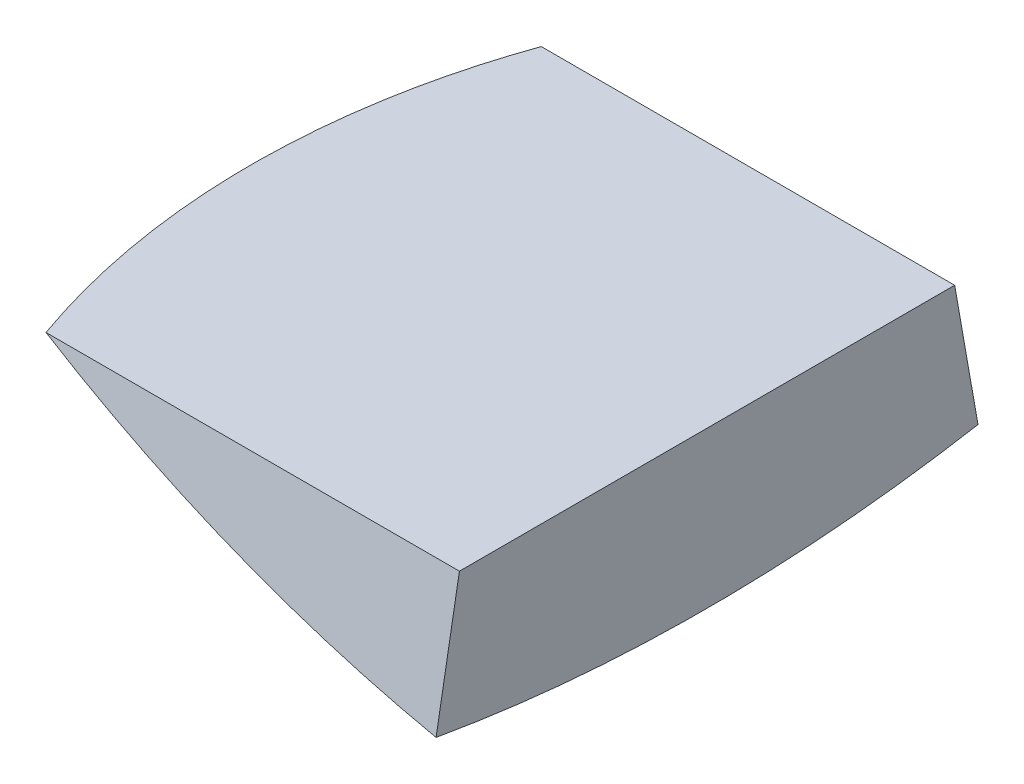
ISO-10303-21;
HEADER;
FILE_DESCRIPTION(('STEP AP214'),'2;1');
FILE_NAME('part.step','',(''),(''),'','','');
FILE_SCHEMA(('AUTOMOTIVE_DESIGN { 1 0 10303 214 1 1 1 1 }'));
ENDSEC;
DATA;
#1=APPLICATION_CONTEXT('core data for automotive mechanical design processes');
#2=APPLICATION_PROTOCOL_DEFINITION('international standard','automotive_design',2000,#1);
#3=PRODUCT_CONTEXT('',#1,'mechanical');
#4=PRODUCT('Part','Part','',(#3));
#5=PRODUCT_RELATED_PRODUCT_CATEGORY('part','',(#4));
#6=PRODUCT_DEFINITION_FORMATION('','',#4);
#7=PRODUCT_DEFINITION_CONTEXT('part definition',#1,'design');
#8=PRODUCT_DEFINITION('design','',#6,#7);
#9=PRODUCT_DEFINITION_SHAPE('','',#8);
#10=(LENGTH_UNIT() NAMED_UNIT(*) SI_UNIT(.MILLI.,.METRE.));
#11=(NAMED_UNIT(*) PLANE_ANGLE_UNIT() SI_UNIT($,.RADIAN.));
#12=(NAMED_UNIT(*) SI_UNIT($,.STERADIAN.) SOLID_ANGLE_UNIT());
#13=UNCERTAINTY_MEASURE_WITH_UNIT(LENGTH_MEASURE(1.E-05),#10,'distance_accuracy_value','');
#14=(GEOMETRIC_REPRESENTATION_CONTEXT(3) GLOBAL_UNCERTAINTY_ASSIGNED_CONTEXT((#13)) GLOBAL_UNIT_ASSIGNED_CONTEXT((#10,
#11,#12)) REPRESENTATION_CONTEXT('',''));
#15=CARTESIAN_POINT('',(0.,0.,0.));
#16=DIRECTION('',(0.,0.,1.));
#17=DIRECTION('',(1.,0.,0.));
#18=AXIS2_PLACEMENT_3D('',#15,#16,#17);
#19=CARTESIAN_POINT('',(-110.266592818501,-615.705846325504,110.266592818501));
#20=DIRECTION('',(-1.,0.,0.));
#21=DIRECTION('',(0.,-1.,0.));
#22=AXIS2_PLACEMENT_3D('',#19,#20,#21);
#23=PLANE('',#22);
#24=DIRECTION('',(0.,0.984807753012208,0.173648177666931));
#25=VECTOR('',#24,1.);
#26=CARTESIAN_POINT('',(-110.266592818501,-615.705846325504,-110.266592818501));
#27=LINE('',#26,#25);
#28=CARTESIAN_POINT('',(-110.266592818501,-615.705846325504,-110.266592818501));
#29=VERTEX_POINT('',#28);
#30=CARTESIAN_POINT('',(-110.266592818501,-561.852923162752,-100.770869474888));
#31=VERTEX_POINT('',#30);
#32=EDGE_CURVE('E77',#29,#31,#27,.T.);
#33=ORIENTED_EDGE('',*,*,#32,.T.);
#34=DIRECTION('',(0.,0.,-1.));
#35=VECTOR('',#34,1.);
#36=CARTESIAN_POINT('',(-110.266592818501,-561.852923162752,217.297250177168));
#37=LINE('',#36,#35);
#38=CARTESIAN_POINT('',(-110.266592818501,-561.852923162752,100.770869474888));
#39=VERTEX_POINT('',#38);
#40=EDGE_CURVE('E46',#39,#31,#37,.T.);
#41=ORIENTED_EDGE('',*,*,#40,.F.);
#42=DIRECTION('',(0.,0.984807753012208,-0.173648177666931));
#43=VECTOR('',#42,1.);
#44=CARTESIAN_POINT('',(-110.266592818501,-615.705846325504,110.266592818501));
#45=LINE('',#44,#43);
#46=CARTESIAN_POINT('',(-110.266592818501,-615.705846325504,110.266592818501));
#47=VERTEX_POINT('',#46);
#48=EDGE_CURVE('E75',#47,#39,#45,.T.);
#49=ORIENTED_EDGE('',*,*,#48,.F.);
#50=CARTESIAN_POINT('',(-110.266592818501,9.64707683724784,0.));
#51=DIRECTION('',(1.,0.,0.));
#52=DIRECTION('',(0.,1.,0.));
#53=AXIS2_PLACEMENT_3D('',#50,#51,#52);
#54=CIRCLE('',#53,635.);
#55=EDGE_CURVE('E40',#47,#29,#54,.T.);
#56=ORIENTED_EDGE('',*,*,#55,.T.);
#57=EDGE_LOOP('',(#33,#41,#49,#56));
#58=FACE_BOUND('',#57,.T.);
#59=ADVANCED_FACE('F33',(#58),#23,.F.);
#60=CARTESIAN_POINT('',(0.,9.64707683724786,0.));
#61=DIRECTION('',(1.,0.,0.));
#62=DIRECTION('',(0.,1.,0.));
#63=AXIS2_PLACEMENT_3D('',#60,#61,#62);
#64=DEGENERATE_TOROIDAL_SURFACE('',#63,9.64707683724786,635.,.T.);
#65=CARTESIAN_POINT('',(0.,0.146560774021677,1.67519731260095));
#66=DIRECTION('',(0.,0.173648177666931,0.984807753012208));
#67=DIRECTION('',(-1.,0.,0.));
#68=AXIS2_PLACEMENT_3D('',#65,#66,#67);
#69=CIRCLE('',#68,635.);
#70=CARTESIAN_POINT('',(-278.498882966349,-561.852923162752,100.770869474888));
#71=VERTEX_POINT('',#70);
#72=EDGE_CURVE('E54',#71,#47,#69,.T.);
#73=ORIENTED_EDGE('',*,*,#72,.F.);
#74=CARTESIAN_POINT('',(-295.882227809429,-561.852923162752,0.));
#75=CARTESIAN_POINT('',(-295.882232415458,-561.852923162752,-4.20901520216265));
#76=CARTESIAN_POINT('',(-295.793924536078,-561.852923162752,-8.4178924958574));
#77=CARTESIAN_POINT('',(-295.440837173891,-561.852923162752,-16.8286004923342));
#78=CARTESIAN_POINT('',(-295.176045638445,-561.852923162752,-21.0304306941985));
#79=CARTESIAN_POINT('',(-294.470330636625,-561.852923162752,-29.4201962956716));
#80=CARTESIAN_POINT('',(-294.029368004405,-561.852923162752,-33.6081283966015));
#81=CARTESIAN_POINT('',(-292.972037773353,-561.852923162752,-41.9618098406062));
#82=CARTESIAN_POINT('',(-292.35566965435,-561.852923162752,-46.1275591178595));
#83=CARTESIAN_POINT('',(-290.947779326335,-561.852923162752,-54.4340255312631));
#84=CARTESIAN_POINT('',(-290.156066937266,-561.852923162752,-58.5747104341505));
#85=CARTESIAN_POINT('',(-288.399184137425,-561.852923162752,-66.8191392226091));
#86=CARTESIAN_POINT('',(-287.434012869947,-561.852923162752,-70.922882925624));
#87=CARTESIAN_POINT('',(-285.331937754039,-561.852923162752,-79.0856651243634));
#88=CARTESIAN_POINT('',(-284.195052943656,-561.852923162752,-83.1447085225935));
#89=CARTESIAN_POINT('',(-281.75126457299,-561.852923162752,-91.2116749937711));
#90=CARTESIAN_POINT('',(-280.444346246694,-561.852923162752,-95.2195935937198));
#91=CARTESIAN_POINT('',(-277.663137779309,-561.852923162752,-103.17570915224));
#92=CARTESIAN_POINT('',(-276.188893299631,-561.852923162752,-107.123922072127));
#93=CARTESIAN_POINT('',(-273.075221608028,-561.852923162752,-114.95468483834));
#94=CARTESIAN_POINT('',(-271.435793866719,-561.852923162752,-118.83723447418));
#95=CARTESIAN_POINT('',(-267.994511288504,-561.852923162752,-126.529729180855));
#96=CARTESIAN_POINT('',(-266.1926544931,-561.852923162752,-130.339673375575));
#97=CARTESIAN_POINT('',(-262.429581180746,-561.852923162752,-137.880063987804));
#98=CARTESIAN_POINT('',(-260.468363691702,-561.852923162752,-141.610509920202));
#99=CARTESIAN_POINT('',(-256.390576428278,-561.852923162752,-148.983959179095));
#100=CARTESIAN_POINT('',(-254.27405620038,-561.852923162752,-152.626989905837));
#101=CARTESIAN_POINT('',(-249.888507860409,-561.852923162752,-159.820615089994));
#102=CARTESIAN_POINT('',(-247.619463207439,-561.852923162752,-163.371199463718));
#103=CARTESIAN_POINT('',(-242.932997991158,-561.852923162752,-170.373034025269));
#104=CARTESIAN_POINT('',(-240.515578193894,-561.852923162752,-173.824284725812));
#105=CARTESIAN_POINT('',(-235.536816852099,-561.852923162752,-180.620788062816));
#106=CARTESIAN_POINT('',(-232.975491118059,-561.852923162752,-183.966052280767));
#107=CARTESIAN_POINT('',(-227.719741333624,-561.852923162752,-190.536588203843));
#108=CARTESIAN_POINT('',(-225.025667183359,-561.852923162752,-193.762139793167));
#109=CARTESIAN_POINT('',(-219.503234570782,-561.852923162752,-200.096129785741));
#110=CARTESIAN_POINT('',(-216.674877042342,-561.852923162752,-203.20456900318));
#111=CARTESIAN_POINT('',(-210.888794609301,-561.852923162752,-209.298662555124));
#112=CARTESIAN_POINT('',(-207.931068797237,-561.852923162752,-212.284316028056));
#113=CARTESIAN_POINT('',(-201.8914876298,-561.852923162752,-218.127292619766));
#114=CARTESIAN_POINT('',(-198.809632844324,-561.852923162752,-220.9846163276));
#115=CARTESIAN_POINT('',(-192.527030276836,-561.852923162752,-226.565835758938));
#116=CARTESIAN_POINT('',(-189.326274945318,-561.852923162752,-229.28972298444));
#117=CARTESIAN_POINT('',(-182.812037814954,-561.852923162752,-234.598573758842));
#118=CARTESIAN_POINT('',(-179.498566316346,-561.852923162752,-237.183549946328));
#119=CARTESIAN_POINT('',(-172.764392193284,-561.852923162752,-242.210133603404));
#120=CARTESIAN_POINT('',(-169.343685188561,-561.852923162752,-244.651735204812));
#121=CARTESIAN_POINT('',(-162.401296338865,-561.852923162752,-249.386891943873));
#122=CARTESIAN_POINT('',(-158.879614649687,-561.852923162752,-251.680447309928));
#123=CARTESIAN_POINT('',(-151.770392116857,-561.852923162752,-256.097332352252));
#124=CARTESIAN_POINT('',(-148.183611429338,-561.852923162752,-258.221885647743));
#125=CARTESIAN_POINT('',(-140.922961358037,-561.852923162752,-262.317359034047));
#126=CARTESIAN_POINT('',(-137.249084271581,-561.852923162752,-264.288265469965));
#127=CARTESIAN_POINT('',(-129.821278794644,-561.852923162752,-268.072488535599));
#128=CARTESIAN_POINT('',(-126.067354462926,-561.852923162752,-269.885813131885));
#129=CARTESIAN_POINT('',(-118.485961028164,-561.852923162752,-273.351626310427));
#130=CARTESIAN_POINT('',(-114.658491651057,-561.852923162752,-275.004114293189));
#131=CARTESIAN_POINT('',(-106.937015947012,-561.852923162752,-278.145115858988));
#132=CARTESIAN_POINT('',(-103.043012097878,-561.852923162752,-279.633635533046));
#133=CARTESIAN_POINT('',(-95.1952886526138,-561.852923162752,-282.444008378013));
#134=CARTESIAN_POINT('',(-91.2415686689721,-561.852923162752,-283.765860466861));
#135=CARTESIAN_POINT('',(-83.2817446476168,-561.852923162752,-286.24035968987));
#136=CARTESIAN_POINT('',(-79.2756432346004,-561.852923162752,-287.393015266913));
#137=CARTESIAN_POINT('',(-71.2177224541668,-561.852923162752,-289.527141506644));
#138=CARTESIAN_POINT('',(-67.1658991205088,-561.852923162752,-290.508597194804));
#139=CARTESIAN_POINT('',(-59.0497982884118,-561.852923162752,-292.292735980849));
#140=CARTESIAN_POINT('',(-54.9857593688751,-561.852923162752,-293.09650455856));
#141=CARTESIAN_POINT('',(-46.827329730954,-561.852923162752,-294.531587308983));
#142=CARTESIAN_POINT('',(-42.7329389097388,-561.852923162752,-295.162900897151));
#143=CARTESIAN_POINT('',(-34.5211700144304,-561.852923162752,-296.251896850176));
#144=CARTESIAN_POINT('',(-30.4037921534289,-561.852923162752,-296.709580821891));
#145=CARTESIAN_POINT('',(-22.1533417738985,-561.852923162752,-297.450481425952));
#146=CARTESIAN_POINT('',(-18.0202691544891,-561.852923162752,-297.733696934957));
#147=CARTESIAN_POINT('',(-9.746119972276,-561.852923162752,-298.125118667828));
#148=CARTESIAN_POINT('',(-5.60504395883795,-561.852923162752,-298.233336504541));
#149=CARTESIAN_POINT('',(2.67834509024551,-561.852923162752,-298.274600578238));
#150=CARTESIAN_POINT('',(6.82065820264665,-561.852923162752,-298.207631410904));
#151=CARTESIAN_POINT('',(15.0985550790781,-561.852923162752,-297.898620109783));
#152=CARTESIAN_POINT('',(19.2341391482414,-561.852923162752,-297.656586149466));
#153=CARTESIAN_POINT('',(27.4913950744033,-561.852923162752,-296.997900975034));
#154=CARTESIAN_POINT('',(31.6130668758152,-561.852923162752,-296.58124906406));
#155=CARTESIAN_POINT('',(39.8240293802154,-561.852923162752,-295.575457149143));
#156=CARTESIAN_POINT('',(43.9133774231372,-561.852923162752,-294.98678517599));
#157=CARTESIAN_POINT('',(52.0636528130288,-561.852923162752,-293.637610534158));
#158=CARTESIAN_POINT('',(56.1245800004034,-561.852923162752,-292.877106901367));
#159=CARTESIAN_POINT('',(64.2105843850185,-561.852923162752,-291.185710605841));
#160=CARTESIAN_POINT('',(68.2356633366841,-561.852923162752,-290.254826330181));
#161=CARTESIAN_POINT('',(76.2433906109693,-561.852923162752,-288.224264869932));
#162=CARTESIAN_POINT('',(80.2260352005096,-561.852923162752,-287.124572963817));
#163=CARTESIAN_POINT('',(88.1412942592999,-561.852923162752,-284.758531242728));
#164=CARTESIAN_POINT('',(92.0739111708839,-561.852923162752,-283.492189598045));
#165=CARTESIAN_POINT('',(99.8823843191981,-561.852923162752,-280.795121136496));
#166=CARTESIAN_POINT('',(103.758240300348,-561.852923162752,-279.364393579698));
#167=CARTESIAN_POINT('',(111.446324688476,-561.852923162752,-276.34118193162));
#168=CARTESIAN_POINT('',(115.258553355701,-561.852923162752,-274.748698502135));
#169=CARTESIAN_POINT('',(122.812717216718,-561.852923162752,-271.404868980849));
#170=CARTESIAN_POINT('',(126.55465196513,-561.852923162752,-269.653521882898));
#171=CARTESIAN_POINT('',(133.96619816721,-561.852923162752,-265.99291455427));
#172=CARTESIAN_POINT('',(137.635714917896,-561.852923162752,-264.083462581505));
#173=CARTESIAN_POINT('',(144.891554921356,-561.852923162752,-260.111824856312));
#174=CARTESIAN_POINT('',(148.477870894386,-561.852923162752,-258.049625804803));
#175=CARTESIAN_POINT('',(155.560541698714,-561.852923162752,-253.776493912109));
#176=CARTESIAN_POINT('',(159.056900716219,-561.852923162752,-251.565568009399));
#177=CARTESIAN_POINT('',(165.953751301834,-561.852923162752,-246.998903287571));
#178=CARTESIAN_POINT('',(169.354242420006,-561.852923162752,-244.643163788964));
#179=CARTESIAN_POINT('',(176.053458496748,-561.852923162752,-239.791127785427));
#180=CARTESIAN_POINT('',(179.352182883912,-561.852923162752,-237.294830491506));
#181=CARTESIAN_POINT('',(185.842134717025,-561.852923162752,-232.16621310681));
#182=CARTESIAN_POINT('',(189.033361534176,-561.852923162752,-229.533892220603));
#183=CARTESIAN_POINT('',(195.302744612229,-561.852923162752,-224.137997583425));
#184=CARTESIAN_POINT('',(198.380905750203,-561.852923162752,-221.374429505601));
#185=CARTESIAN_POINT('',(204.418977523545,-561.852923162752,-215.721033180888));
#186=CARTESIAN_POINT('',(207.378877871475,-561.852923162752,-212.831193995329));
#187=CARTESIAN_POINT('',(216.102598396328,-561.852923162752,-203.950056129998));
#188=CARTESIAN_POINT('',(221.680396785433,-561.852923162752,-197.772990320555));
#189=CARTESIAN_POINT('',(229.64239406756,-561.852923162752,-188.175916400988));
#190=CARTESIAN_POINT('',(232.229207581868,-561.852923162752,-184.921266502036));
#191=CARTESIAN_POINT('',(237.264390826149,-561.852923162752,-178.306577753023));
#192=CARTESIAN_POINT('',(239.712760568759,-561.852923162752,-174.946538912583));
#193=CARTESIAN_POINT('',(246.843931405692,-561.852923162752,-164.716694173704));
#194=CARTESIAN_POINT('',(251.313804031952,-561.852923162752,-157.695942313726));
#195=CARTESIAN_POINT('',(257.566278179383,-561.852923162752,-146.90640105445));
#196=CARTESIAN_POINT('',(259.575282927844,-561.852923162752,-143.266319750946));
#197=CARTESIAN_POINT('',(263.439806047013,-561.852923162752,-135.905541304722));
#198=CARTESIAN_POINT('',(265.295337293957,-561.852923162752,-132.184850958119));
#199=CARTESIAN_POINT('',(268.863439424505,-561.852923162752,-124.640526555852));
#200=CARTESIAN_POINT('',(270.574798376748,-561.852923162752,-120.816320134947));
#201=CARTESIAN_POINT('',(273.835634093318,-561.852923162752,-113.099497717339));
#202=CARTESIAN_POINT('',(275.385111594052,-561.852923162752,-109.206882031928));
#203=CARTESIAN_POINT('',(278.319602245564,-561.852923162752,-101.360118033851));
#204=CARTESIAN_POINT('',(279.704614056582,-561.852923162752,-97.4059692202259));
#205=CARTESIAN_POINT('',(282.307860261977,-561.852923162752,-89.4431634941703));
#206=CARTESIAN_POINT('',(283.526095246163,-561.852923162752,-85.4345067745633));
#207=CARTESIAN_POINT('',(285.793870575221,-561.852923162752,-77.3694075466555));
#208=CARTESIAN_POINT('',(286.843397201344,-561.852923162752,-73.3129611810315));
#209=CARTESIAN_POINT('',(288.771825334751,-561.852923162752,-65.1600799048332));
#210=CARTESIAN_POINT('',(289.65074143408,-561.852923162752,-61.063648445623));
#211=CARTESIAN_POINT('',(291.236656246998,-561.852923162752,-52.8374343761098));
#212=CARTESIAN_POINT('',(291.943646568439,-561.852923162752,-48.7076501479328));
#213=CARTESIAN_POINT('',(293.18449392377,-561.852923162752,-40.4221761012006));
#214=CARTESIAN_POINT('',(293.718351779138,-561.852923162752,-36.2664864056566));
#215=CARTESIAN_POINT('',(294.61530018129,-561.852923162752,-27.906300320219));
#216=CARTESIAN_POINT('',(294.977127384061,-561.852923162752,-23.7016683379093));
#217=CARTESIAN_POINT('',(295.523654063874,-561.852923162752,-15.2809248517663));
#218=CARTESIAN_POINT('',(295.708354125229,-561.852923162752,-11.064813385848));
#219=CARTESIAN_POINT('',(295.900328599875,-561.852923162752,-2.62833958981482));
#220=CARTESIAN_POINT('',(295.907594057681,-561.852923162752,1.59202294410912));
#221=CARTESIAN_POINT('',(295.744671573499,-561.852923162752,10.0289529355945));
#222=CARTESIAN_POINT('',(295.574499113312,-561.852923162752,14.2455206921322));
#223=CARTESIAN_POINT('',(295.056988591005,-561.852923162752,22.6680531684751));
#224=CARTESIAN_POINT('',(294.709638707212,-561.852923162752,26.874017161953));
#225=CARTESIAN_POINT('',(293.838344242238,-561.852923162752,35.2675882125749));
#226=CARTESIAN_POINT('',(293.314400749167,-561.852923162752,39.4551953826663));
#227=CARTESIAN_POINT('',(292.090783171559,-561.852923162752,47.8046812996442));
#228=CARTESIAN_POINT('',(291.391108110212,-561.852923162752,51.9665599033856));
#229=CARTESIAN_POINT('',(289.817194283639,-561.852923162752,60.2571595119502));
#230=CARTESIAN_POINT('',(288.942956265861,-561.852923162752,64.3858806586689));
#231=CARTESIAN_POINT('',(287.019015330222,-561.852923162752,72.6129106562908));
#232=CARTESIAN_POINT('',(285.968887743525,-561.852923162752,76.7111202063006));
#233=CARTESIAN_POINT('',(283.696535508241,-561.852923162752,84.8591609591883));
#234=CARTESIAN_POINT('',(282.474325929035,-561.852923162752,88.9089963645826));
#235=CARTESIAN_POINT('',(279.859733757494,-561.852923162752,96.953584660159));
#236=CARTESIAN_POINT('',(278.467342614284,-561.852923162752,100.948334771316));
#237=CARTESIAN_POINT('',(275.514801470295,-561.852923162752,108.875323793021));
#238=CARTESIAN_POINT('',(273.95465253828,-561.852923162752,112.807563101635));
#239=CARTESIAN_POINT('',(270.669248017795,-561.852923162752,120.602433261913));
#240=CARTESIAN_POINT('',(268.943993195116,-561.852923162752,124.465064436333));
#241=CARTESIAN_POINT('',(265.331326203371,-561.852923162752,132.113715129738));
#242=CARTESIAN_POINT('',(263.443914832657,-561.852923162752,135.899735025792));
#243=CARTESIAN_POINT('',(259.510081467684,-561.852923162752,143.388457304694));
#244=CARTESIAN_POINT('',(257.463652541553,-561.852923162752,147.091156046332));
#245=CARTESIAN_POINT('',(253.215576121284,-561.852923162752,154.405977341506));
#246=CARTESIAN_POINT('',(251.013942525319,-561.852923162752,158.018107966008));
#247=CARTESIAN_POINT('',(246.468652879225,-561.852923162752,165.130588141323));
#248=CARTESIAN_POINT('',(244.125630174529,-561.852923162752,168.631342446481));
#249=CARTESIAN_POINT('',(239.293356890292,-561.852923162752,175.530397218778));
#250=CARTESIAN_POINT('',(236.804107357754,-561.852923162752,178.928698419231));
#251=CARTESIAN_POINT('',(231.683678141534,-561.852923162752,185.616667290838));
#252=CARTESIAN_POINT('',(229.052497713897,-561.852923162752,188.906334392421));
#253=CARTESIAN_POINT('',(223.652827738365,-561.852923162752,195.370955307197));
#254=CARTESIAN_POINT('',(220.884338875094,-561.852923162752,198.545909692215));
#255=CARTESIAN_POINT('',(215.214843032986,-561.852923162752,204.775329498583));
#256=CARTESIAN_POINT('',(212.313833392821,-561.852923162752,207.829792497886));
#257=CARTESIAN_POINT('',(206.384735655707,-561.852923162752,213.812236259338));
#258=CARTESIAN_POINT('',(203.356659169174,-561.852923162752,216.740228528037));
#259=CARTESIAN_POINT('',(197.178419342046,-561.852923162752,222.464708506625));
#260=CARTESIAN_POINT('',(194.028250945746,-561.852923162752,225.26119076018));
#261=CARTESIAN_POINT('',(187.611556005159,-561.852923162752,230.71730922793));
#262=CARTESIAN_POINT('',(184.345029635951,-561.852923162752,233.376945648018));
#263=CARTESIAN_POINT('',(177.727661629721,-561.852923162752,238.533984363049));
#264=CARTESIAN_POINT('',(174.377688133556,-561.852923162752,241.032500714693));
#265=CARTESIAN_POINT('',(167.574573419731,-561.852923162752,245.885557764526));
#266=CARTESIAN_POINT('',(164.121423063457,-561.852923162752,248.240085652714));
#267=CARTESIAN_POINT('',(157.11854309631,-561.852923162752,252.800452128585));
#268=CARTESIAN_POINT('',(153.568818350559,-561.852923162752,255.006298187009));
#269=CARTESIAN_POINT('',(146.378928651851,-561.852923162752,259.265348208903));
#270=CARTESIAN_POINT('',(142.738763369767,-561.852923162752,261.318551616776));
#271=CARTESIAN_POINT('',(135.374640345156,-561.852923162752,265.268418991671));
#272=CARTESIAN_POINT('',(131.650685644989,-561.852923162752,267.165088630737));
#273=CARTESIAN_POINT('',(124.125502338692,-561.852923162752,270.79845027763));
#274=CARTESIAN_POINT('',(120.324273227422,-561.852923162752,272.53514123927));
#275=CARTESIAN_POINT('',(112.651587718601,-561.852923162752,275.845205998887));
#276=CARTESIAN_POINT('',(108.780134882247,-561.852923162752,277.418588051561));
#277=CARTESIAN_POINT('',(100.973441980681,-561.852923162752,280.399324537209));
#278=CARTESIAN_POINT('',(97.0381963671436,-561.852923162752,281.806664439719));
#279=CARTESIAN_POINT('',(89.1396293989262,-561.852923162752,284.443082859509));
#280=CARTESIAN_POINT('',(85.1767084815883,-561.852923162752,285.673361214449));
#281=CARTESIAN_POINT('',(77.2023662613941,-561.852923162752,287.965224254355));
#282=CARTESIAN_POINT('',(73.1909448032849,-561.852923162752,289.026808399168));
#283=CARTESIAN_POINT('',(65.1268181707367,-561.852923162752,290.979302768969));
#284=CARTESIAN_POINT('',(61.0741133867434,-561.852923162752,291.870214606551));
#285=CARTESIAN_POINT('',(52.9346033100245,-561.852923162752,293.479731263911));
#286=CARTESIAN_POINT('',(48.847797796663,-561.852923162752,294.19833496794));
#287=CARTESIAN_POINT('',(40.6477051780575,-561.852923162752,295.461852546385));
#288=CARTESIAN_POINT('',(36.5344198699997,-561.852923162752,296.00677808417));
#289=CARTESIAN_POINT('',(28.2881023432619,-561.852923162752,296.92203423375));
#290=CARTESIAN_POINT('',(24.1550684152781,-561.852923162752,297.292349445484));
#291=CARTESIAN_POINT('',(15.8772227022748,-561.852923162752,297.857612716));
#292=CARTESIAN_POINT('',(11.7324114850368,-561.852923162752,298.052569089598));
#293=CARTESIAN_POINT('',(3.43823401849336,-561.852923162752,298.266782950004));
#294=CARTESIAN_POINT('',(-0.711132248324937,-561.852923162752,298.286039758915));
#295=CARTESIAN_POINT('',(-8.99080908885613,-561.852923162752,298.149084346221));
#296=CARTESIAN_POINT('',(-13.1211309712851,-561.852923162752,297.993554795922));
#297=CARTESIAN_POINT('',(-21.3715612828187,-561.852923162752,297.508410468283));
#298=CARTESIAN_POINT('',(-25.4916696569431,-561.852923162752,297.178794755858));
#299=CARTESIAN_POINT('',(-33.7141244640997,-561.852923162752,296.346104383277));
#300=CARTESIAN_POINT('',(-37.8164717217676,-561.852923162752,295.843037865694));
#301=CARTESIAN_POINT('',(-45.9966390422789,-561.852923162752,294.664320837182));
#302=CARTESIAN_POINT('',(-50.0744570711142,-561.852923162752,293.98865621065));
#303=CARTESIAN_POINT('',(-58.1977889293276,-561.852923162752,292.466042616069));
#304=CARTESIAN_POINT('',(-62.2433042738728,-561.852923162752,291.619101731429));
#305=CARTESIAN_POINT('',(-70.2950461848766,-561.852923162752,289.75547324145));
#306=CARTESIAN_POINT('',(-74.3012727415896,-561.852923162752,288.738785594005));
#307=CARTESIAN_POINT('',(-82.2674994587175,-561.852923162752,286.537486250842));
#308=CARTESIAN_POINT('',(-86.2274977057171,-561.852923162752,285.352867630852));
#309=CARTESIAN_POINT('',(-94.0937713230519,-561.852923162752,282.81801519175));
#310=CARTESIAN_POINT('',(-98.0000510377289,-561.852923162752,281.467794853874));
#311=CARTESIAN_POINT('',(-105.752702312357,-561.852923162752,278.603994874345));
#312=CARTESIAN_POINT('',(-109.599067885832,-561.852923162752,277.090399026901));
#313=CARTESIAN_POINT('',(-117.224691047795,-561.852923162752,273.902737310737));
#314=CARTESIAN_POINT('',(-121.003949037212,-561.852923162752,272.228672401106));
#315=CARTESIAN_POINT('',(-128.488748707956,-561.852923162752,268.723116778195));
#316=CARTESIAN_POINT('',(-132.194290118085,-561.852923162752,266.891625485885));
#317=CARTESIAN_POINT('',(-139.525129650821,-561.852923162752,263.074569096115));
#318=CARTESIAN_POINT('',(-143.150428074797,-561.852923162752,261.089004577432));
#319=CARTESIAN_POINT('',(-150.314500219365,-561.852923162752,256.967383355237));
#320=CARTESIAN_POINT('',(-153.853272883475,-561.852923162752,254.83132481542));
#321=CARTESIAN_POINT('',(-160.837777765047,-561.852923162752,250.412805434263));
#322=CARTESIAN_POINT('',(-164.283517972582,-561.852923162752,248.130357222767));
#323=CARTESIAN_POINT('',(-171.076450980575,-561.852923162752,243.422914377832));
#324=CARTESIAN_POINT('',(-174.423639107648,-561.852923162752,240.997913000742));
#325=CARTESIAN_POINT('',(-181.013486213572,-561.852923162752,236.009855610791));
#326=CARTESIAN_POINT('',(-184.256145743596,-561.852923162752,233.446800326067));
#327=CARTESIAN_POINT('',(-190.643573253612,-561.852923162752,228.177166391666));
#328=CARTESIAN_POINT('',(-193.787918856947,-561.852923162752,225.470075760014));
#329=CARTESIAN_POINT('',(-199.960214808571,-561.852923162752,219.926326657961));
#330=CARTESIAN_POINT('',(-202.988165514978,-561.852923162752,217.089668586266));
#331=CARTESIAN_POINT('',(-208.922613785698,-561.852923162752,211.291749721239));
#332=CARTESIAN_POINT('',(-211.829105358847,-561.852923162752,208.330482795803));
#333=CARTESIAN_POINT('',(-217.515248237145,-561.852923162752,202.289061488691));
#334=CARTESIAN_POINT('',(-220.294910429986,-561.852923162752,199.20891735411));
#335=CARTESIAN_POINT('',(-225.723785009389,-561.852923162752,192.93401843668));
#336=CARTESIAN_POINT('',(-228.372955452545,-561.852923162752,189.739227366382));
#337=CARTESIAN_POINT('',(-233.535378163649,-561.852923162752,183.241692183817));
#338=CARTESIAN_POINT('',(-236.048631282309,-561.852923162752,179.938948747437));
#339=CARTESIAN_POINT('',(-240.93497227586,-561.852923162752,173.231391100737));
#340=CARTESIAN_POINT('',(-243.308061102079,-561.852923162752,169.82657758343));
#341=CARTESIAN_POINT('',(-247.910093216499,-561.852923162752,162.920908821033));
#342=CARTESIAN_POINT('',(-250.139036889627,-561.852923162752,159.420053832451));
#343=CARTESIAN_POINT('',(-254.465340317605,-561.852923162752,152.301685184602));
#344=CARTESIAN_POINT('',(-256.561578852282,-561.852923162752,148.683490037278));
#345=CARTESIAN_POINT('',(-260.600230538413,-561.852923162752,141.362650060059));
#346=CARTESIAN_POINT('',(-262.542656723835,-561.852923162752,137.660012420093));
#347=CARTESIAN_POINT('',(-266.27082796988,-561.852923162752,130.176159205423));
#348=CARTESIAN_POINT('',(-268.056555320514,-561.852923162752,126.394934808479));
#349=CARTESIAN_POINT('',(-271.468086465504,-561.852923162752,118.761043634707));
#350=CARTESIAN_POINT('',(-273.093891082582,-561.852923162752,114.908377225534));
#351=CARTESIAN_POINT('',(-276.181275370498,-561.852923162752,107.142433503445));
#352=CARTESIAN_POINT('',(-277.64302395476,-561.852923162752,103.229223340843));
#353=CARTESIAN_POINT('',(-280.40181771661,-561.852923162752,95.3451885712436));
#354=CARTESIAN_POINT('',(-281.698863322188,-561.852923162752,91.3743641139903));
#355=CARTESIAN_POINT('',(-284.125860592948,-561.852923162752,83.3828959286402));
#356=CARTESIAN_POINT('',(-285.25584840083,-561.852923162752,79.3622631810962));
#357=CARTESIAN_POINT('',(-287.34712899548,-561.852923162752,71.2777254614541));
#358=CARTESIAN_POINT('',(-288.308432973324,-561.852923162752,67.2138233789829));
#359=CARTESIAN_POINT('',(-290.297124663292,-561.852923162752,57.9487816955032));
#360=CARTESIAN_POINT('',(-291.272473798537,-561.852923162752,52.7363849693096));
#361=CARTESIAN_POINT('',(-292.946087965468,-561.852923162752,42.268568260016));
#362=CARTESIAN_POINT('',(-293.644412803443,-561.852923162752,37.0131578133956));
#363=CARTESIAN_POINT('',(-294.762495201029,-561.852923162752,26.4727815825136));
#364=CARTESIAN_POINT('',(-295.182252410965,-561.852923162752,21.1878157611608));
#365=CARTESIAN_POINT('',(-295.74214630909,-561.852923162752,10.6018292152294));
#366=CARTESIAN_POINT('',(-295.882222008627,-561.852923162752,5.30080524128308));
#367=CARTESIAN_POINT('',(-295.882227809429,-561.852923162752,0.));
#368=B_SPLINE_CURVE_WITH_KNOTS('',3,(#74,#75,#76,#77,#78,#79,#80,#81,#82,#83,#84,#85,#86,#87,
#88,#89,#90,#91,#92,#93,#94,#95,#96,#97,#98,#99,#100,#101,#102,#103,#104,#105,#106,#107,#108,
#109,#110,#111,#112,#113,#114,#115,#116,#117,#118,#119,#120,#121,#122,#123,#124,#125,#126,#127,
#128,#129,#130,#131,#132,#133,#134,#135,#136,#137,#138,#139,#140,#141,#142,#143,#144,#145,#146,
#147,#148,#149,#150,#151,#152,#153,#154,#155,#156,#157,#158,#159,#160,#161,#162,#163,#164,#165,
#166,#167,#168,#169,#170,#171,#172,#173,#174,#175,#176,#177,#178,#179,#180,#181,#182,#183,#184,
#185,#186,#187,#188,#189,#190,#191,#192,#193,#194,#195,#196,#197,#198,#199,#200,#201,#202,#203,
#204,#205,#206,#207,#208,#209,#210,#211,#212,#213,#214,#215,#216,#217,#218,#219,#220,#221,#222,
#223,#224,#225,#226,#227,#228,#229,#230,#231,#232,#233,#234,#235,#236,#237,#238,#239,#240,#241,
#242,#243,#244,#245,#246,#247,#248,#249,#250,#251,#252,#253,#254,#255,#256,#257,#258,#259,#260,
#261,#262,#263,#264,#265,#266,#267,#268,#269,#270,#271,#272,#273,#274,#275,#276,#277,#278,#279,
#280,#281,#282,#283,#284,#285,#286,#287,#288,#289,#290,#291,#292,#293,#294,#295,#296,#297,#298,
#299,#300,#301,#302,#303,#304,#305,#306,#307,#308,#309,#310,#311,#312,#313,#314,#315,#316,#317,
#318,#319,#320,#321,#322,#323,#324,#325,#326,#327,#328,#329,#330,#331,#332,#333,#334,#335,#336,
#337,#338,#339,#340,#341,#342,#343,#344,#345,#346,#347,#348,#349,#350,#351,#352,#353,#354,#355,
#356,#357,#358,#359,#360,#361,#362,#363,#364,#365,#366,#367),.UNSPECIFIED.,.T.,.F.,(4,2,2,2,2,2,
2,2,2,2,2,2,2,2,2,2,2,2,2,2,2,2,2,2,2,2,2,2,2,2,2,2,2,2,2,2,2,2,2,2,2,2,2,2,2,2,2,2,2,2,2,2,2,2,
2,2,2,2,2,2,2,2,2,2,2,2,2,2,2,2,2,2,2,2,2,2,2,2,2,2,2,2,2,2,2,2,2,2,2,2,2,2,2,2,2,2,2,2,2,2,2,2,
2,2,2,2,2,2,2,2,2,2,2,2,2,2,2,2,2,2,2,2,2,2,2,2,2,2,2,2,2,2,2,2,2,2,2,2,2,2,2,2,2,2,2,2,4),(0.,
12.6258808476296,25.2526240457688,37.8821759482439,50.5117653045961,63.1551205070106,
75.7985381561798,88.4405550449031,101.0836705225,113.723344095072,126.363058176934,
139.002924683377,151.642868298347,164.27879675945,176.916097773374,189.553333547528,
202.189183613149,214.793344815213,227.397418374665,240.001580360531,252.605684485267,
265.210590271136,277.81434727252,290.418619774492,303.022872830427,315.525479059612,
328.029195156076,340.532278757416,353.035408960184,365.53807454547,378.040821298144,
390.542943953394,403.046159597771,415.47074273892,427.895367993231,440.31987826086,
452.744468524612,465.168234258549,477.593092459686,490.017370603306,502.441698329804,
514.832531882351,527.223434959007,539.613728250995,552.005102701108,564.395869868883,
576.786692812085,589.177465062457,601.568315794194,613.974420062161,626.381605752878,
638.788213018471,651.19487850223,663.601613635018,676.008421327493,688.414693224152,
700.822041995872,725.75528704074,738.224676035577,750.694063892149,775.628107802974,
788.098429531291,800.567703951648,813.133073348221,825.698385581956,838.263800167505,
850.82917031414,863.395561714686,875.96087785788,888.526807224022,901.09267696664,
913.749453569742,926.406188420085,939.063562080195,951.71983145234,964.376945389509,
977.033981339327,989.691087645373,1002.34813975711,1015.03620367588,1027.72315717932,
1040.41074840857,1053.09825881161,1065.78571037053,1078.47309946827,1091.16104194356,
1103.8478496865,1116.48152980774,1129.11511948126,1141.74877538241,1154.38236829811,
1167.01621503765,1179.64890989385,1192.28212841741,1204.91532793296,1217.44889379161,
1229.9835730876,1242.51762208969,1255.05171671159,1267.58535695758,1280.11907916193,
1292.6521675213,1305.18635184767,1317.63113742689,1330.07596285313,1342.52067068888,
1354.9654591059,1367.40941161622,1379.85446143746,1392.29892113303,1404.74342884258,
1417.13949986377,1429.53563746987,1441.93119322388,1454.32776304935,1466.72374795338,
1479.11973593218,1491.51623518148,1503.9117259306,1516.30844736388,1528.70509470914,
1541.10178765246,1553.4984340298,1565.89523169531,1578.29096125579,1590.68727768405,
1603.08352873687,1615.52724589361,1627.97092476102,1640.4152167099,1652.85843835866,
1665.30563382356,1677.75275137197,1690.199784429,1702.64678424578,1715.18781210568,
1727.72777610649,1740.2691555444,1752.81047045985,1765.33875192427,1777.86700083264,
1790.39253529449,1802.91723845414,1818.81813572004,1834.7155982985,1850.61308083234,
1866.51402966677),.UNSPECIFIED.);
#369=CARTESIAN_POINT('',(-278.49888296635,-561.852923162752,-100.770869474888));
#370=VERTEX_POINT('',#369);
#371=EDGE_CURVE('E68',#71,#370,#368,.T.);
#372=ORIENTED_EDGE('',*,*,#371,.T.);
#373=CARTESIAN_POINT('',(0.,0.146560774021677,-1.67519731260095));
#374=DIRECTION('',(0.,-0.173648177666931,0.984807753012208));
#375=DIRECTION('',(-1.,0.,0.));
#376=AXIS2_PLACEMENT_3D('',#373,#374,#375);
#377=CIRCLE('',#376,635.);
#378=EDGE_CURVE('E69',#370,#29,#377,.T.);
#379=ORIENTED_EDGE('',*,*,#378,.T.);
#380=ORIENTED_EDGE('',*,*,#55,.F.);
#381=EDGE_LOOP('',(#73,#372,#379,#380));
#382=FACE_BOUND('',#381,.T.);
#383=ADVANCED_FACE('F88',(#382),#64,.T.);
#384=CARTESIAN_POINT('',(0.,0.146560774021677,1.67519731260095));
#385=DIRECTION('',(0.,-0.173648177666931,-0.984807753012208));
#386=DIRECTION('',(-1.,0.,0.));
#387=AXIS2_PLACEMENT_3D('',#384,#385,#386);
#388=PLANE('',#387);
#389=ORIENTED_EDGE('',*,*,#48,.T.);
#390=DIRECTION('',(-1.,0.,0.));
#391=VECTOR('',#390,1.);
#392=CARTESIAN_POINT('',(0.,-561.852923162752,100.770869474888));
#393=LINE('',#392,#391);
#394=EDGE_CURVE('E65',#39,#71,#393,.T.);
#395=ORIENTED_EDGE('',*,*,#394,.T.);
#396=ORIENTED_EDGE('',*,*,#72,.T.);
#397=EDGE_LOOP('',(#389,#395,#396));
#398=FACE_BOUND('',#397,.T.);
#399=ADVANCED_FACE('F79',(#398),#388,.F.);
#400=CARTESIAN_POINT('',(0.,0.146560774021677,-1.67519731260095));
#401=DIRECTION('',(0.,0.173648177666931,-0.984807753012208));
#402=DIRECTION('',(-1.,0.,0.));
#403=AXIS2_PLACEMENT_3D('',#400,#401,#402);
#404=PLANE('',#403);
#405=DIRECTION('',(-1.,0.,0.));
#406=VECTOR('',#405,1.);
#407=CARTESIAN_POINT('',(0.,-561.852923162752,-100.770869474888));
#408=LINE('',#407,#406);
#409=EDGE_CURVE('E11',#31,#370,#408,.T.);
#410=ORIENTED_EDGE('',*,*,#409,.F.);
#411=ORIENTED_EDGE('',*,*,#32,.F.);
#412=ORIENTED_EDGE('',*,*,#378,.F.);
#413=EDGE_LOOP('',(#410,#411,#412));
#414=FACE_BOUND('',#413,.T.);
#415=ADVANCED_FACE('F94',(#414),#404,.T.);
#416=CARTESIAN_POINT('',(-359.037429077349,-561.852923162752,217.297250177168));
#417=DIRECTION('',(0.,-1.,0.));
#418=DIRECTION('',(0.,0.,-1.));
#419=AXIS2_PLACEMENT_3D('',#416,#417,#418);
#420=PLANE('',#419);
#421=ORIENTED_EDGE('',*,*,#40,.T.);
#422=ORIENTED_EDGE('',*,*,#409,.T.);
#423=ORIENTED_EDGE('',*,*,#371,.F.);
#424=ORIENTED_EDGE('',*,*,#394,.F.);
#425=EDGE_LOOP('',(#421,#422,#423,#424));
#426=FACE_BOUND('',#425,.T.);
#427=ADVANCED_FACE('F66',(#426),#420,.F.);
#428=CLOSED_SHELL('',(#59,#383,#399,#415,#427));
#429=MANIFOLD_SOLID_BREP('B2',#428);
#430=ADVANCED_BREP_SHAPE_REPRESENTATION('',(#18,#429),#14);
#431=SHAPE_DEFINITION_REPRESENTATION(#9,#430);
ENDSEC;
END-ISO-10303-21;
